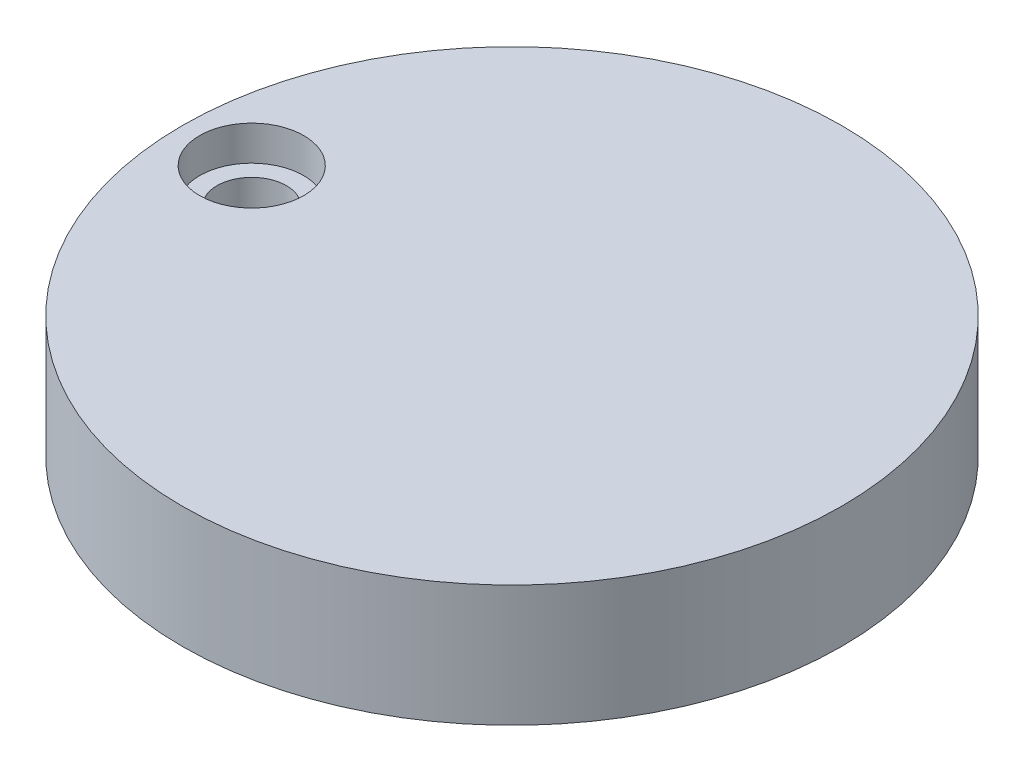
ISO-10303-21;
HEADER;
FILE_DESCRIPTION(('STEP AP214'),'2;1');
FILE_NAME('part.step','',(''),(''),'','','');
FILE_SCHEMA(('AUTOMOTIVE_DESIGN { 1 0 10303 214 1 1 1 1 }'));
ENDSEC;
DATA;
#1=APPLICATION_CONTEXT('core data for automotive mechanical design processes');
#2=APPLICATION_PROTOCOL_DEFINITION('international standard','automotive_design',2000,#1);
#3=PRODUCT_CONTEXT('',#1,'mechanical');
#4=PRODUCT('Part','Part','',(#3));
#5=PRODUCT_RELATED_PRODUCT_CATEGORY('part','',(#4));
#6=PRODUCT_DEFINITION_FORMATION('','',#4);
#7=PRODUCT_DEFINITION_CONTEXT('part definition',#1,'design');
#8=PRODUCT_DEFINITION('design','',#6,#7);
#9=PRODUCT_DEFINITION_SHAPE('','',#8);
#10=(LENGTH_UNIT() NAMED_UNIT(*) SI_UNIT(.MILLI.,.METRE.));
#11=(NAMED_UNIT(*) PLANE_ANGLE_UNIT() SI_UNIT($,.RADIAN.));
#12=(NAMED_UNIT(*) SI_UNIT($,.STERADIAN.) SOLID_ANGLE_UNIT());
#13=UNCERTAINTY_MEASURE_WITH_UNIT(LENGTH_MEASURE(1.E-05),#10,'distance_accuracy_value','');
#14=(GEOMETRIC_REPRESENTATION_CONTEXT(3) GLOBAL_UNCERTAINTY_ASSIGNED_CONTEXT((#13)) GLOBAL_UNIT_ASSIGNED_CONTEXT((#10,
#11,#12)) REPRESENTATION_CONTEXT('',''));
#15=CARTESIAN_POINT('',(0.,0.,0.));
#16=DIRECTION('',(0.,0.,1.));
#17=DIRECTION('',(1.,0.,0.));
#18=AXIS2_PLACEMENT_3D('',#15,#16,#17);
#19=CARTESIAN_POINT('',(-15.,7.,0.));
#20=DIRECTION('',(0.,-1.,0.));
#21=DIRECTION('',(0.,0.,-1.));
#22=AXIS2_PLACEMENT_3D('',#19,#20,#21);
#23=CYLINDRICAL_SURFACE('',#22,2.);
#24=CARTESIAN_POINT('',(-15.,0.,0.));
#25=DIRECTION('',(0.,1.,0.));
#26=DIRECTION('',(0.,0.,1.));
#27=AXIS2_PLACEMENT_3D('',#24,#25,#26);
#28=CIRCLE('',#27,2.);
#29=CARTESIAN_POINT('',(-15.,0.,2.));
#30=VERTEX_POINT('',#29);
#31=EDGE_CURVE('E49',#30,#30,#28,.T.);
#32=ORIENTED_EDGE('',*,*,#31,.F.);
#33=EDGE_LOOP('',(#32));
#34=FACE_BOUND('',#33,.T.);
#35=CARTESIAN_POINT('',(-15.,5.,0.));
#36=DIRECTION('',(0.,1.,0.));
#37=DIRECTION('',(0.,0.,1.));
#38=AXIS2_PLACEMENT_3D('',#35,#36,#37);
#39=CIRCLE('',#38,2.);
#40=CARTESIAN_POINT('',(-15.,5.,2.));
#41=VERTEX_POINT('',#40);
#42=EDGE_CURVE('E35',#41,#41,#39,.T.);
#43=ORIENTED_EDGE('',*,*,#42,.T.);
#44=EDGE_LOOP('',(#43));
#45=FACE_BOUND('',#44,.T.);
#46=ADVANCED_FACE('F31',(#34,#45),#23,.F.);
#47=CARTESIAN_POINT('',(0.,7.,0.));
#48=DIRECTION('',(0.,-1.,0.));
#49=DIRECTION('',(0.,0.,-1.));
#50=AXIS2_PLACEMENT_3D('',#47,#48,#49);
#51=CYLINDRICAL_SURFACE('',#50,19.);
#52=CARTESIAN_POINT('',(0.,7.,0.));
#53=DIRECTION('',(0.,1.,0.));
#54=DIRECTION('',(0.,0.,1.));
#55=AXIS2_PLACEMENT_3D('',#52,#53,#54);
#56=CIRCLE('',#55,19.);
#57=CARTESIAN_POINT('',(0.,7.,19.));
#58=VERTEX_POINT('',#57);
#59=EDGE_CURVE('E10',#58,#58,#56,.T.);
#60=ORIENTED_EDGE('',*,*,#59,.F.);
#61=EDGE_LOOP('',(#60));
#62=FACE_BOUND('',#61,.T.);
#63=CARTESIAN_POINT('',(0.,0.,0.));
#64=DIRECTION('',(0.,1.,0.));
#65=DIRECTION('',(0.,0.,1.));
#66=AXIS2_PLACEMENT_3D('',#63,#64,#65);
#67=CIRCLE('',#66,19.);
#68=CARTESIAN_POINT('',(0.,0.,19.));
#69=VERTEX_POINT('',#68);
#70=EDGE_CURVE('E39',#69,#69,#67,.T.);
#71=ORIENTED_EDGE('',*,*,#70,.T.);
#72=EDGE_LOOP('',(#71));
#73=FACE_BOUND('',#72,.T.);
#74=ADVANCED_FACE('F33',(#62,#73),#51,.T.);
#75=CARTESIAN_POINT('',(0.,7.,0.));
#76=DIRECTION('',(0.,1.,0.));
#77=DIRECTION('',(0.,0.,1.));
#78=AXIS2_PLACEMENT_3D('',#75,#76,#77);
#79=PLANE('',#78);
#80=CARTESIAN_POINT('',(-15.,7.,0.));
#81=DIRECTION('',(0.,1.,0.));
#82=DIRECTION('',(0.,0.,1.));
#83=AXIS2_PLACEMENT_3D('',#80,#81,#82);
#84=CIRCLE('',#83,3.);
#85=CARTESIAN_POINT('',(-15.,7.,3.));
#86=VERTEX_POINT('',#85);
#87=EDGE_CURVE('E54',#86,#86,#84,.T.);
#88=ORIENTED_EDGE('',*,*,#87,.F.);
#89=EDGE_LOOP('',(#88));
#90=FACE_BOUND('',#89,.T.);
#91=ORIENTED_EDGE('',*,*,#59,.T.);
#92=EDGE_LOOP('',(#91));
#93=FACE_BOUND('',#92,.T.);
#94=ADVANCED_FACE('F81',(#90,#93),#79,.T.);
#95=CARTESIAN_POINT('',(0.,0.,0.));
#96=DIRECTION('',(0.,1.,0.));
#97=DIRECTION('',(0.,0.,1.));
#98=AXIS2_PLACEMENT_3D('',#95,#96,#97);
#99=PLANE('',#98);
#100=ORIENTED_EDGE('',*,*,#31,.T.);
#101=EDGE_LOOP('',(#100));
#102=FACE_BOUND('',#101,.T.);
#103=CARTESIAN_POINT('',(0.,0.,0.));
#104=DIRECTION('',(0.,1.,0.));
#105=DIRECTION('',(0.,0.,1.));
#106=AXIS2_PLACEMENT_3D('',#103,#104,#105);
#107=CIRCLE('',#106,6.);
#108=CARTESIAN_POINT('',(0.,0.,6.));
#109=VERTEX_POINT('',#108);
#110=EDGE_CURVE('E46',#109,#109,#107,.T.);
#111=ORIENTED_EDGE('',*,*,#110,.T.);
#112=EDGE_LOOP('',(#111));
#113=FACE_BOUND('',#112,.T.);
#114=ORIENTED_EDGE('',*,*,#70,.F.);
#115=EDGE_LOOP('',(#114));
#116=FACE_BOUND('',#115,.T.);
#117=ADVANCED_FACE('F91',(#102,#113,#116),#99,.F.);
#118=CARTESIAN_POINT('',(0.,-8.,0.));
#119=DIRECTION('',(0.,1.,0.));
#120=DIRECTION('',(0.,0.,1.));
#121=AXIS2_PLACEMENT_3D('',#118,#119,#120);
#122=CYLINDRICAL_SURFACE('',#121,6.);
#123=CARTESIAN_POINT('',(0.,-8.,0.));
#124=DIRECTION('',(0.,1.,0.));
#125=DIRECTION('',(0.,0.,1.));
#126=AXIS2_PLACEMENT_3D('',#123,#124,#125);
#127=CIRCLE('',#126,6.);
#128=CARTESIAN_POINT('',(0.,-8.,6.));
#129=VERTEX_POINT('',#128);
#130=EDGE_CURVE('E44',#129,#129,#127,.T.);
#131=ORIENTED_EDGE('',*,*,#130,.T.);
#132=EDGE_LOOP('',(#131));
#133=FACE_BOUND('',#132,.T.);
#134=ORIENTED_EDGE('',*,*,#110,.F.);
#135=EDGE_LOOP('',(#134));
#136=FACE_BOUND('',#135,.T.);
#137=ADVANCED_FACE('F87',(#133,#136),#122,.T.);
#138=CARTESIAN_POINT('',(0.,-8.,0.));
#139=DIRECTION('',(0.,1.,0.));
#140=DIRECTION('',(0.,0.,1.));
#141=AXIS2_PLACEMENT_3D('',#138,#139,#140);
#142=PLANE('',#141);
#143=ORIENTED_EDGE('',*,*,#130,.F.);
#144=EDGE_LOOP('',(#143));
#145=FACE_BOUND('',#144,.T.);
#146=ADVANCED_FACE('F72',(#145),#142,.F.);
#147=CARTESIAN_POINT('',(-15.,5.,0.));
#148=DIRECTION('',(0.,1.,0.));
#149=DIRECTION('',(0.,0.,1.));
#150=AXIS2_PLACEMENT_3D('',#147,#148,#149);
#151=CYLINDRICAL_SURFACE('',#150,3.);
#152=CARTESIAN_POINT('',(-15.,5.,0.));
#153=DIRECTION('',(0.,1.,0.));
#154=DIRECTION('',(0.,0.,1.));
#155=AXIS2_PLACEMENT_3D('',#152,#153,#154);
#156=CIRCLE('',#155,3.);
#157=CARTESIAN_POINT('',(-15.,5.,3.));
#158=VERTEX_POINT('',#157);
#159=EDGE_CURVE('E57',#158,#158,#156,.T.);
#160=ORIENTED_EDGE('',*,*,#159,.F.);
#161=EDGE_LOOP('',(#160));
#162=FACE_BOUND('',#161,.T.);
#163=ORIENTED_EDGE('',*,*,#87,.T.);
#164=EDGE_LOOP('',(#163));
#165=FACE_BOUND('',#164,.T.);
#166=ADVANCED_FACE('F67',(#162,#165),#151,.F.);
#167=CARTESIAN_POINT('',(-15.,5.,0.));
#168=DIRECTION('',(0.,1.,0.));
#169=DIRECTION('',(0.,0.,1.));
#170=AXIS2_PLACEMENT_3D('',#167,#168,#169);
#171=PLANE('',#170);
#172=ORIENTED_EDGE('',*,*,#42,.F.);
#173=EDGE_LOOP('',(#172));
#174=FACE_BOUND('',#173,.T.);
#175=ORIENTED_EDGE('',*,*,#159,.T.);
#176=EDGE_LOOP('',(#175));
#177=FACE_BOUND('',#176,.T.);
#178=ADVANCED_FACE('F65',(#174,#177),#171,.T.);
#179=CLOSED_SHELL('',(#46,#74,#94,#117,#137,#146,#166,#178));
#180=MANIFOLD_SOLID_BREP('B2',#179);
#181=ADVANCED_BREP_SHAPE_REPRESENTATION('',(#18,#180),#14);
#182=SHAPE_DEFINITION_REPRESENTATION(#9,#181);
ENDSEC;
END-ISO-10303-21;
